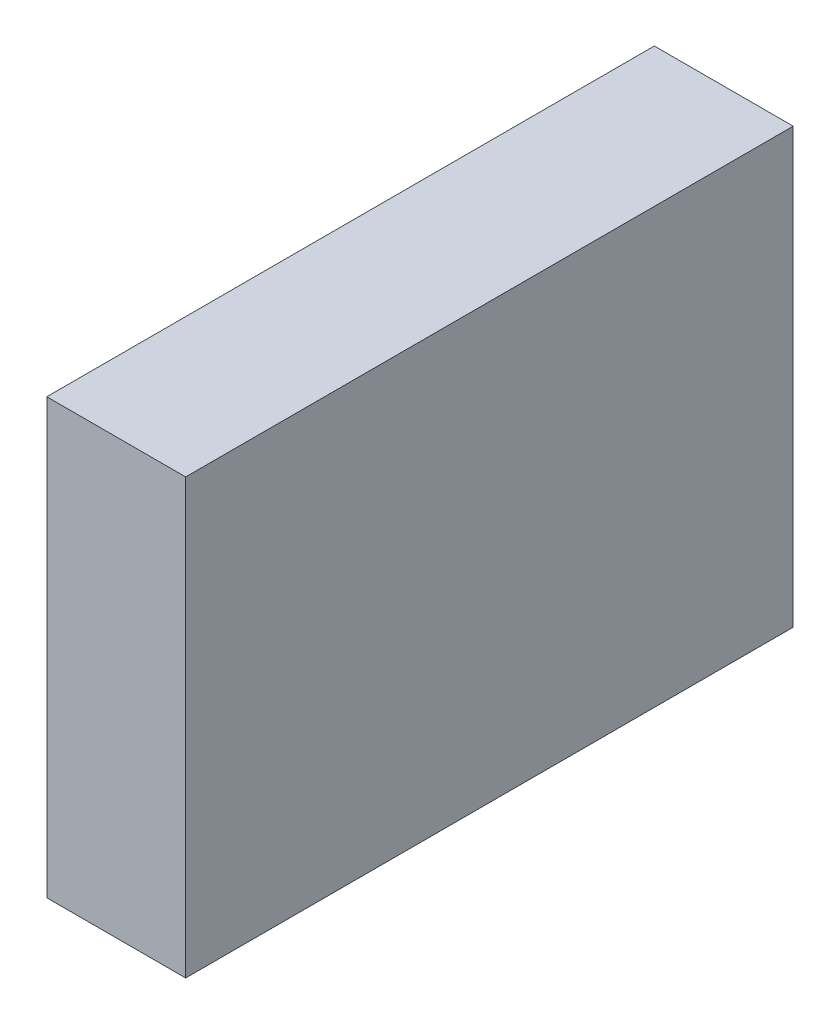
ISO-10303-21;
HEADER;
FILE_DESCRIPTION(('STEP AP214'),'2;1');
FILE_NAME('part.step','',(''),(''),'','','');
FILE_SCHEMA(('AUTOMOTIVE_DESIGN { 1 0 10303 214 1 1 1 1 }'));
ENDSEC;
DATA;
#1=APPLICATION_CONTEXT('core data for automotive mechanical design processes');
#2=APPLICATION_PROTOCOL_DEFINITION('international standard','automotive_design',2000,#1);
#3=PRODUCT_CONTEXT('',#1,'mechanical');
#4=PRODUCT('Part','Part','',(#3));
#5=PRODUCT_RELATED_PRODUCT_CATEGORY('part','',(#4));
#6=PRODUCT_DEFINITION_FORMATION('','',#4);
#7=PRODUCT_DEFINITION_CONTEXT('part definition',#1,'design');
#8=PRODUCT_DEFINITION('design','',#6,#7);
#9=PRODUCT_DEFINITION_SHAPE('','',#8);
#10=(LENGTH_UNIT() NAMED_UNIT(*) SI_UNIT(.MILLI.,.METRE.));
#11=(NAMED_UNIT(*) PLANE_ANGLE_UNIT() SI_UNIT($,.RADIAN.));
#12=(NAMED_UNIT(*) SI_UNIT($,.STERADIAN.) SOLID_ANGLE_UNIT());
#13=UNCERTAINTY_MEASURE_WITH_UNIT(LENGTH_MEASURE(1.E-05),#10,'distance_accuracy_value','');
#14=(GEOMETRIC_REPRESENTATION_CONTEXT(3) GLOBAL_UNCERTAINTY_ASSIGNED_CONTEXT((#13)) GLOBAL_UNIT_ASSIGNED_CONTEXT((#10,
#11,#12)) REPRESENTATION_CONTEXT('',''));
#15=CARTESIAN_POINT('',(0.,0.,0.));
#16=DIRECTION('',(0.,0.,1.));
#17=DIRECTION('',(1.,0.,0.));
#18=AXIS2_PLACEMENT_3D('',#15,#16,#17);
#19=CARTESIAN_POINT('',(8.,-12.5,-17.5));
#20=DIRECTION('',(0.,0.,1.));
#21=DIRECTION('',(1.,0.,0.));
#22=AXIS2_PLACEMENT_3D('',#19,#20,#21);
#23=PLANE('',#22);
#24=DIRECTION('',(0.,1.,0.));
#25=VECTOR('',#24,1.);
#26=CARTESIAN_POINT('',(0.,-12.5,-17.5));
#27=LINE('',#26,#25);
#28=CARTESIAN_POINT('',(0.,-12.5,-17.5));
#29=VERTEX_POINT('',#28);
#30=CARTESIAN_POINT('',(0.,12.5,-17.5));
#31=VERTEX_POINT('',#30);
#32=EDGE_CURVE('E100',#29,#31,#27,.T.);
#33=ORIENTED_EDGE('',*,*,#32,.T.);
#34=DIRECTION('',(-1.,0.,0.));
#35=VECTOR('',#34,1.);
#36=CARTESIAN_POINT('',(8.,12.5,-17.5));
#37=LINE('',#36,#35);
#38=CARTESIAN_POINT('',(8.,12.5,-17.5));
#39=VERTEX_POINT('',#38);
#40=EDGE_CURVE('E11',#39,#31,#37,.T.);
#41=ORIENTED_EDGE('',*,*,#40,.F.);
#42=DIRECTION('',(0.,1.,0.));
#43=VECTOR('',#42,1.);
#44=CARTESIAN_POINT('',(8.,-12.5,-17.5));
#45=LINE('',#44,#43);
#46=CARTESIAN_POINT('',(8.,-12.5,-17.5));
#47=VERTEX_POINT('',#46);
#48=EDGE_CURVE('E88',#47,#39,#45,.T.);
#49=ORIENTED_EDGE('',*,*,#48,.F.);
#50=DIRECTION('',(-1.,0.,0.));
#51=VECTOR('',#50,1.);
#52=CARTESIAN_POINT('',(8.,-12.5,-17.5));
#53=LINE('',#52,#51);
#54=EDGE_CURVE('E96',#47,#29,#53,.T.);
#55=ORIENTED_EDGE('',*,*,#54,.T.);
#56=EDGE_LOOP('',(#33,#41,#49,#55));
#57=FACE_BOUND('',#56,.T.);
#58=ADVANCED_FACE('F37',(#57),#23,.F.);
#59=CARTESIAN_POINT('',(8.,12.5,17.5));
#60=DIRECTION('',(0.,-1.,0.));
#61=DIRECTION('',(0.,0.,-1.));
#62=AXIS2_PLACEMENT_3D('',#59,#60,#61);
#63=PLANE('',#62);
#64=DIRECTION('',(0.,0.,1.));
#65=VECTOR('',#64,1.);
#66=CARTESIAN_POINT('',(0.,12.5,17.5));
#67=LINE('',#66,#65);
#68=CARTESIAN_POINT('',(0.,12.5,17.5));
#69=VERTEX_POINT('',#68);
#70=EDGE_CURVE('E92',#31,#69,#67,.T.);
#71=ORIENTED_EDGE('',*,*,#70,.T.);
#72=DIRECTION('',(-1.,0.,0.));
#73=VECTOR('',#72,1.);
#74=CARTESIAN_POINT('',(8.,12.5,17.5));
#75=LINE('',#74,#73);
#76=CARTESIAN_POINT('',(8.,12.5,17.5));
#77=VERTEX_POINT('',#76);
#78=EDGE_CURVE('E45',#77,#69,#75,.T.);
#79=ORIENTED_EDGE('',*,*,#78,.F.);
#80=DIRECTION('',(0.,0.,1.));
#81=VECTOR('',#80,1.);
#82=CARTESIAN_POINT('',(8.,12.5,17.5));
#83=LINE('',#82,#81);
#84=EDGE_CURVE('E83',#39,#77,#83,.T.);
#85=ORIENTED_EDGE('',*,*,#84,.F.);
#86=ORIENTED_EDGE('',*,*,#40,.T.);
#87=EDGE_LOOP('',(#71,#79,#85,#86));
#88=FACE_BOUND('',#87,.T.);
#89=ADVANCED_FACE('F91',(#88),#63,.F.);
#90=CARTESIAN_POINT('',(8.,-12.5,17.5));
#91=DIRECTION('',(0.,0.,-1.));
#92=DIRECTION('',(-1.,0.,0.));
#93=AXIS2_PLACEMENT_3D('',#90,#91,#92);
#94=PLANE('',#93);
#95=DIRECTION('',(0.,-1.,0.));
#96=VECTOR('',#95,1.);
#97=CARTESIAN_POINT('',(0.,-12.5,17.5));
#98=LINE('',#97,#96);
#99=CARTESIAN_POINT('',(0.,-12.5,17.5));
#100=VERTEX_POINT('',#99);
#101=EDGE_CURVE('E70',#69,#100,#98,.T.);
#102=ORIENTED_EDGE('',*,*,#101,.T.);
#103=DIRECTION('',(-1.,0.,0.));
#104=VECTOR('',#103,1.);
#105=CARTESIAN_POINT('',(8.,-12.5,17.5));
#106=LINE('',#105,#104);
#107=CARTESIAN_POINT('',(8.,-12.5,17.5));
#108=VERTEX_POINT('',#107);
#109=EDGE_CURVE('E93',#108,#100,#106,.T.);
#110=ORIENTED_EDGE('',*,*,#109,.F.);
#111=DIRECTION('',(0.,-1.,0.));
#112=VECTOR('',#111,1.);
#113=CARTESIAN_POINT('',(8.,-12.5,17.5));
#114=LINE('',#113,#112);
#115=EDGE_CURVE('E86',#77,#108,#114,.T.);
#116=ORIENTED_EDGE('',*,*,#115,.F.);
#117=ORIENTED_EDGE('',*,*,#78,.T.);
#118=EDGE_LOOP('',(#102,#110,#116,#117));
#119=FACE_BOUND('',#118,.T.);
#120=ADVANCED_FACE('F94',(#119),#94,.F.);
#121=CARTESIAN_POINT('',(8.,-12.5,17.5));
#122=DIRECTION('',(0.,1.,0.));
#123=DIRECTION('',(0.,0.,1.));
#124=AXIS2_PLACEMENT_3D('',#121,#122,#123);
#125=PLANE('',#124);
#126=DIRECTION('',(0.,0.,-1.));
#127=VECTOR('',#126,1.);
#128=CARTESIAN_POINT('',(0.,-12.5,17.5));
#129=LINE('',#128,#127);
#130=EDGE_CURVE('E76',#100,#29,#129,.T.);
#131=ORIENTED_EDGE('',*,*,#130,.T.);
#132=ORIENTED_EDGE('',*,*,#54,.F.);
#133=DIRECTION('',(0.,0.,-1.));
#134=VECTOR('',#133,1.);
#135=CARTESIAN_POINT('',(8.,-12.5,17.5));
#136=LINE('',#135,#134);
#137=EDGE_CURVE('E53',#108,#47,#136,.T.);
#138=ORIENTED_EDGE('',*,*,#137,.F.);
#139=ORIENTED_EDGE('',*,*,#109,.T.);
#140=EDGE_LOOP('',(#131,#132,#138,#139));
#141=FACE_BOUND('',#140,.T.);
#142=ADVANCED_FACE('F107',(#141),#125,.F.);
#143=CARTESIAN_POINT('',(8.,0.,0.));
#144=DIRECTION('',(-1.,0.,0.));
#145=DIRECTION('',(0.,0.,1.));
#146=AXIS2_PLACEMENT_3D('',#143,#144,#145);
#147=PLANE('',#146);
#148=ORIENTED_EDGE('',*,*,#48,.T.);
#149=ORIENTED_EDGE('',*,*,#84,.T.);
#150=ORIENTED_EDGE('',*,*,#115,.T.);
#151=ORIENTED_EDGE('',*,*,#137,.T.);
#152=EDGE_LOOP('',(#148,#149,#150,#151));
#153=FACE_BOUND('',#152,.T.);
#154=ADVANCED_FACE('F84',(#153),#147,.F.);
#155=CARTESIAN_POINT('',(0.,0.,0.));
#156=DIRECTION('',(-1.,0.,0.));
#157=DIRECTION('',(0.,0.,1.));
#158=AXIS2_PLACEMENT_3D('',#155,#156,#157);
#159=PLANE('',#158);
#160=ORIENTED_EDGE('',*,*,#32,.F.);
#161=ORIENTED_EDGE('',*,*,#130,.F.);
#162=ORIENTED_EDGE('',*,*,#101,.F.);
#163=ORIENTED_EDGE('',*,*,#70,.F.);
#164=EDGE_LOOP('',(#160,#161,#162,#163));
#165=FACE_BOUND('',#164,.T.);
#166=ADVANCED_FACE('F110',(#165),#159,.T.);
#167=CLOSED_SHELL('',(#58,#89,#120,#142,#154,#166));
#168=MANIFOLD_SOLID_BREP('B2',#167);
#169=ADVANCED_BREP_SHAPE_REPRESENTATION('',(#18,#168),#14);
#170=SHAPE_DEFINITION_REPRESENTATION(#9,#169);
ENDSEC;
END-ISO-10303-21;
